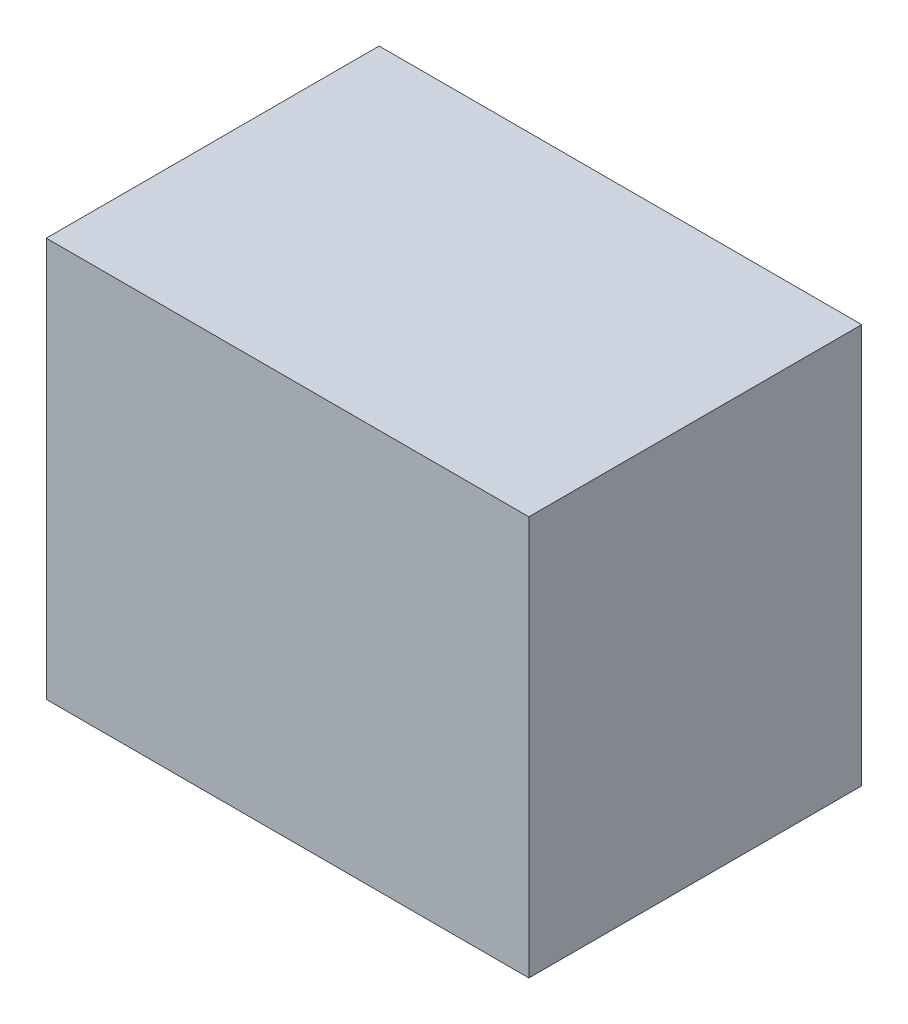
ISO-10303-21;
HEADER;
FILE_DESCRIPTION(('STEP AP214'),'2;1');
FILE_NAME('part.step','',(''),(''),'','','');
FILE_SCHEMA(('AUTOMOTIVE_DESIGN { 1 0 10303 214 1 1 1 1 }'));
ENDSEC;
DATA;
#1=APPLICATION_CONTEXT('core data for automotive mechanical design processes');
#2=APPLICATION_PROTOCOL_DEFINITION('international standard','automotive_design',2000,#1);
#3=PRODUCT_CONTEXT('',#1,'mechanical');
#4=PRODUCT('Part','Part','',(#3));
#5=PRODUCT_RELATED_PRODUCT_CATEGORY('part','',(#4));
#6=PRODUCT_DEFINITION_FORMATION('','',#4);
#7=PRODUCT_DEFINITION_CONTEXT('part definition',#1,'design');
#8=PRODUCT_DEFINITION('design','',#6,#7);
#9=PRODUCT_DEFINITION_SHAPE('','',#8);
#10=(LENGTH_UNIT() NAMED_UNIT(*) SI_UNIT(.MILLI.,.METRE.));
#11=(NAMED_UNIT(*) PLANE_ANGLE_UNIT() SI_UNIT($,.RADIAN.));
#12=(NAMED_UNIT(*) SI_UNIT($,.STERADIAN.) SOLID_ANGLE_UNIT());
#13=UNCERTAINTY_MEASURE_WITH_UNIT(LENGTH_MEASURE(1.E-05),#10,'distance_accuracy_value','');
#14=(GEOMETRIC_REPRESENTATION_CONTEXT(3) GLOBAL_UNCERTAINTY_ASSIGNED_CONTEXT((#13)) GLOBAL_UNIT_ASSIGNED_CONTEXT((#10,
#11,#12)) REPRESENTATION_CONTEXT('',''));
#15=CARTESIAN_POINT('',(0.,0.,0.));
#16=DIRECTION('',(0.,0.,1.));
#17=DIRECTION('',(1.,0.,0.));
#18=AXIS2_PLACEMENT_3D('',#15,#16,#17);
#19=CARTESIAN_POINT('',(0.72499982,0.60000134,0.));
#20=DIRECTION('',(0.,-1.,0.));
#21=DIRECTION('',(-1.,0.,0.));
#22=AXIS2_PLACEMENT_3D('',#19,#20,#21);
#23=PLANE('',#22);
#24=DIRECTION('',(-1.,0.,0.));
#25=VECTOR('',#24,1.);
#26=CARTESIAN_POINT('',(0.72499982,0.60000134,0.));
#27=LINE('',#26,#25);
#28=CARTESIAN_POINT('',(0.72499982,0.60000134,0.));
#29=VERTEX_POINT('',#28);
#30=CARTESIAN_POINT('',(-0.72499982,0.60000134,0.));
#31=VERTEX_POINT('',#30);
#32=EDGE_CURVE('E11',#29,#31,#27,.T.);
#33=ORIENTED_EDGE('',*,*,#32,.T.);
#34=DIRECTION('',(0.,0.,1.));
#35=VECTOR('',#34,1.);
#36=CARTESIAN_POINT('',(-0.72499982,0.60000134,0.));
#37=LINE('',#36,#35);
#38=CARTESIAN_POINT('',(-0.72499982,0.60000134,1.00000054));
#39=VERTEX_POINT('',#38);
#40=EDGE_CURVE('E23',#31,#39,#37,.T.);
#41=ORIENTED_EDGE('',*,*,#40,.T.);
#42=DIRECTION('',(-1.,0.,0.));
#43=VECTOR('',#42,1.);
#44=CARTESIAN_POINT('',(0.72499982,0.60000134,1.00000054));
#45=LINE('',#44,#43);
#46=CARTESIAN_POINT('',(0.72499982,0.60000134,1.00000054));
#47=VERTEX_POINT('',#46);
#48=EDGE_CURVE('E86',#47,#39,#45,.T.);
#49=ORIENTED_EDGE('',*,*,#48,.F.);
#50=DIRECTION('',(0.,0.,1.));
#51=VECTOR('',#50,1.);
#52=CARTESIAN_POINT('',(0.72499982,0.60000134,0.));
#53=LINE('',#52,#51);
#54=EDGE_CURVE('E35',#29,#47,#53,.T.);
#55=ORIENTED_EDGE('',*,*,#54,.F.);
#56=EDGE_LOOP('',(#33,#41,#49,#55));
#57=FACE_BOUND('',#56,.T.);
#58=ADVANCED_FACE('F16',(#57),#23,.F.);
#59=CARTESIAN_POINT('',(-0.72499982,0.60000134,0.));
#60=DIRECTION('',(1.,0.,0.));
#61=DIRECTION('',(0.,-1.,0.));
#62=AXIS2_PLACEMENT_3D('',#59,#60,#61);
#63=PLANE('',#62);
#64=DIRECTION('',(0.,-1.,0.));
#65=VECTOR('',#64,1.);
#66=CARTESIAN_POINT('',(-0.72499982,0.60000134,0.));
#67=LINE('',#66,#65);
#68=CARTESIAN_POINT('',(-0.72499982,-0.5999988,0.));
#69=VERTEX_POINT('',#68);
#70=EDGE_CURVE('E83',#31,#69,#67,.T.);
#71=ORIENTED_EDGE('',*,*,#70,.T.);
#72=DIRECTION('',(0.,0.,1.));
#73=VECTOR('',#72,1.);
#74=CARTESIAN_POINT('',(-0.72499982,-0.5999988,0.));
#75=LINE('',#74,#73);
#76=CARTESIAN_POINT('',(-0.72499982,-0.5999988,1.00000054));
#77=VERTEX_POINT('',#76);
#78=EDGE_CURVE('E81',#69,#77,#75,.T.);
#79=ORIENTED_EDGE('',*,*,#78,.T.);
#80=DIRECTION('',(0.,-1.,0.));
#81=VECTOR('',#80,1.);
#82=CARTESIAN_POINT('',(-0.72499982,0.60000134,1.00000054));
#83=LINE('',#82,#81);
#84=EDGE_CURVE('E61',#39,#77,#83,.T.);
#85=ORIENTED_EDGE('',*,*,#84,.F.);
#86=ORIENTED_EDGE('',*,*,#40,.F.);
#87=EDGE_LOOP('',(#71,#79,#85,#86));
#88=FACE_BOUND('',#87,.T.);
#89=ADVANCED_FACE('F88',(#88),#63,.F.);
#90=CARTESIAN_POINT('',(-0.72499982,-0.5999988,0.));
#91=DIRECTION('',(0.,1.,0.));
#92=DIRECTION('',(1.,0.,0.));
#93=AXIS2_PLACEMENT_3D('',#90,#91,#92);
#94=PLANE('',#93);
#95=DIRECTION('',(1.,0.,0.));
#96=VECTOR('',#95,1.);
#97=CARTESIAN_POINT('',(-0.72499982,-0.5999988,0.));
#98=LINE('',#97,#96);
#99=CARTESIAN_POINT('',(0.72499982,-0.5999988,0.));
#100=VERTEX_POINT('',#99);
#101=EDGE_CURVE('E70',#69,#100,#98,.T.);
#102=ORIENTED_EDGE('',*,*,#101,.T.);
#103=DIRECTION('',(0.,0.,1.));
#104=VECTOR('',#103,1.);
#105=CARTESIAN_POINT('',(0.72499982,-0.5999988,0.));
#106=LINE('',#105,#104);
#107=CARTESIAN_POINT('',(0.72499982,-0.5999988,1.00000054));
#108=VERTEX_POINT('',#107);
#109=EDGE_CURVE('E64',#100,#108,#106,.T.);
#110=ORIENTED_EDGE('',*,*,#109,.T.);
#111=DIRECTION('',(1.,0.,0.));
#112=VECTOR('',#111,1.);
#113=CARTESIAN_POINT('',(-0.72499982,-0.5999988,1.00000054));
#114=LINE('',#113,#112);
#115=EDGE_CURVE('E56',#77,#108,#114,.T.);
#116=ORIENTED_EDGE('',*,*,#115,.F.);
#117=ORIENTED_EDGE('',*,*,#78,.F.);
#118=EDGE_LOOP('',(#102,#110,#116,#117));
#119=FACE_BOUND('',#118,.T.);
#120=ADVANCED_FACE('F68',(#119),#94,.F.);
#121=CARTESIAN_POINT('',(0.72499982,-0.5999988,0.));
#122=DIRECTION('',(-1.,0.,0.));
#123=DIRECTION('',(0.,1.,0.));
#124=AXIS2_PLACEMENT_3D('',#121,#122,#123);
#125=PLANE('',#124);
#126=DIRECTION('',(0.,1.,0.));
#127=VECTOR('',#126,1.);
#128=CARTESIAN_POINT('',(0.72499982,-0.5999988,0.));
#129=LINE('',#128,#127);
#130=EDGE_CURVE('E65',#100,#29,#129,.T.);
#131=ORIENTED_EDGE('',*,*,#130,.T.);
#132=ORIENTED_EDGE('',*,*,#54,.T.);
#133=DIRECTION('',(0.,1.,0.));
#134=VECTOR('',#133,1.);
#135=CARTESIAN_POINT('',(0.72499982,-0.5999988,1.00000054));
#136=LINE('',#135,#134);
#137=EDGE_CURVE('E60',#108,#47,#136,.T.);
#138=ORIENTED_EDGE('',*,*,#137,.F.);
#139=ORIENTED_EDGE('',*,*,#109,.F.);
#140=EDGE_LOOP('',(#131,#132,#138,#139));
#141=FACE_BOUND('',#140,.T.);
#142=ADVANCED_FACE('F75',(#141),#125,.F.);
#143=CARTESIAN_POINT('',(0.72499982,0.60000134,0.));
#144=DIRECTION('',(0.,0.,-1.));
#145=DIRECTION('',(-1.,0.,0.));
#146=AXIS2_PLACEMENT_3D('',#143,#144,#145);
#147=PLANE('',#146);
#148=ORIENTED_EDGE('',*,*,#130,.F.);
#149=ORIENTED_EDGE('',*,*,#101,.F.);
#150=ORIENTED_EDGE('',*,*,#70,.F.);
#151=ORIENTED_EDGE('',*,*,#32,.F.);
#152=EDGE_LOOP('',(#148,#149,#150,#151));
#153=FACE_BOUND('',#152,.T.);
#154=ADVANCED_FACE('F90',(#153),#147,.T.);
#155=CARTESIAN_POINT('',(0.72499982,0.60000134,1.00000054));
#156=DIRECTION('',(0.,0.,-1.));
#157=DIRECTION('',(-1.,0.,0.));
#158=AXIS2_PLACEMENT_3D('',#155,#156,#157);
#159=PLANE('',#158);
#160=ORIENTED_EDGE('',*,*,#48,.T.);
#161=ORIENTED_EDGE('',*,*,#84,.T.);
#162=ORIENTED_EDGE('',*,*,#115,.T.);
#163=ORIENTED_EDGE('',*,*,#137,.T.);
#164=EDGE_LOOP('',(#160,#161,#162,#163));
#165=FACE_BOUND('',#164,.T.);
#166=ADVANCED_FACE('F58',(#165),#159,.F.);
#167=CLOSED_SHELL('',(#58,#89,#120,#142,#154,#166));
#168=MANIFOLD_SOLID_BREP('B1',#167);
#169=ADVANCED_BREP_SHAPE_REPRESENTATION('',(#18,#168),#14);
#170=SHAPE_DEFINITION_REPRESENTATION(#9,#169);
ENDSEC;
END-ISO-10303-21;
